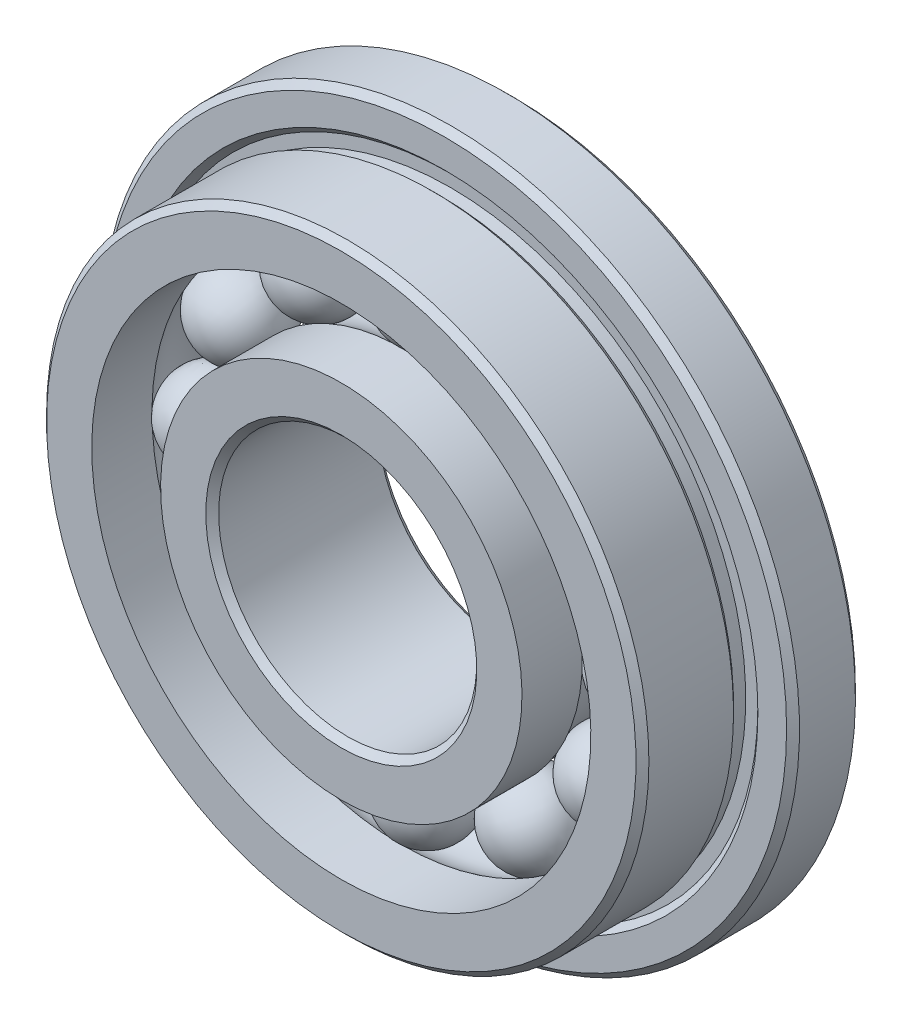
ISO-10303-21;
HEADER;
FILE_DESCRIPTION(('STEP AP214'),'2;1');
FILE_NAME('part.step','',(''),(''),'','','');
FILE_SCHEMA(('AUTOMOTIVE_DESIGN { 1 0 10303 214 1 1 1 1 }'));
ENDSEC;
DATA;
#1=APPLICATION_CONTEXT('core data for automotive mechanical design processes');
#2=APPLICATION_PROTOCOL_DEFINITION('international standard','automotive_design',2000,#1);
#3=PRODUCT_CONTEXT('',#1,'mechanical');
#4=PRODUCT('Part','Part','',(#3));
#5=PRODUCT_RELATED_PRODUCT_CATEGORY('part','',(#4));
#6=PRODUCT_DEFINITION_FORMATION('','',#4);
#7=PRODUCT_DEFINITION_CONTEXT('part definition',#1,'design');
#8=PRODUCT_DEFINITION('design','',#6,#7);
#9=PRODUCT_DEFINITION_SHAPE('','',#8);
#10=(LENGTH_UNIT() NAMED_UNIT(*) SI_UNIT(.MILLI.,.METRE.));
#11=(NAMED_UNIT(*) PLANE_ANGLE_UNIT() SI_UNIT($,.RADIAN.));
#12=(NAMED_UNIT(*) SI_UNIT($,.STERADIAN.) SOLID_ANGLE_UNIT());
#13=UNCERTAINTY_MEASURE_WITH_UNIT(LENGTH_MEASURE(1.E-05),#10,'distance_accuracy_value','');
#14=(GEOMETRIC_REPRESENTATION_CONTEXT(3) GLOBAL_UNCERTAINTY_ASSIGNED_CONTEXT((#13)) GLOBAL_UNIT_ASSIGNED_CONTEXT((#10,
#11,#12)) REPRESENTATION_CONTEXT('',''));
#15=CARTESIAN_POINT('',(0.,0.,0.));
#16=DIRECTION('',(0.,0.,1.));
#17=DIRECTION('',(1.,0.,0.));
#18=AXIS2_PLACEMENT_3D('',#15,#16,#17);
#19=CARTESIAN_POINT('',(-1.24999999999997,2.16506350946111,0.));
#20=DIRECTION('',(-0.499999999999989,0.866025403784445,0.));
#21=DIRECTION('',(0.866025403784445,0.499999999999989,0.));
#22=AXIS2_PLACEMENT_3D('',#19,#20,#21);
#23=SPHERICAL_SURFACE('',#22,0.5);
#24=CARTESIAN_POINT('',(-1.49999999999997,2.59807621135334,0.));
#25=VERTEX_POINT('',#24);
#26=VERTEX_LOOP('',#25);
#27=FACE_BOUND('',#26,.T.);
#28=ADVANCED_FACE('F39',(#27),#23,.T.);
#29=CLOSED_SHELL('',(#28));
#30=MANIFOLD_SOLID_BREP('B2',#29);
#31=CARTESIAN_POINT('',(-2.16506350946108,1.25000000000002,0.));
#32=DIRECTION('',(-0.866025403784433,0.50000000000001,0.));
#33=DIRECTION('',(0.50000000000001,0.866025403784433,0.));
#34=AXIS2_PLACEMENT_3D('',#31,#32,#33);
#35=SPHERICAL_SURFACE('',#34,0.5);
#36=CARTESIAN_POINT('',(-2.5980762113533,1.50000000000003,0.));
#37=VERTEX_POINT('',#36);
#38=VERTEX_LOOP('',#37);
#39=FACE_BOUND('',#38,.T.);
#40=ADVANCED_FACE('F57',(#39),#35,.T.);
#41=CLOSED_SHELL('',(#40));
#42=MANIFOLD_SOLID_BREP('B7',#41);
#43=CARTESIAN_POINT('',(-2.5,0.,0.));
#44=DIRECTION('',(-1.,0.,0.));
#45=DIRECTION('',(0.,1.,0.));
#46=AXIS2_PLACEMENT_3D('',#43,#44,#45);
#47=SPHERICAL_SURFACE('',#46,0.5);
#48=CARTESIAN_POINT('',(-3.,0.,0.));
#49=VERTEX_POINT('',#48);
#50=VERTEX_LOOP('',#49);
#51=FACE_BOUND('',#50,.T.);
#52=ADVANCED_FACE('F75',(#51),#47,.T.);
#53=CLOSED_SHELL('',(#52));
#54=MANIFOLD_SOLID_BREP('B35',#53);
#55=CARTESIAN_POINT('',(-2.16506350946111,-1.24999999999998,0.));
#56=DIRECTION('',(-0.866025403784443,-0.499999999999992,0.));
#57=DIRECTION('',(-0.499999999999992,0.866025403784443,0.));
#58=AXIS2_PLACEMENT_3D('',#55,#56,#57);
#59=SPHERICAL_SURFACE('',#58,0.5);
#60=CARTESIAN_POINT('',(-2.59807621135333,-1.49999999999998,0.));
#61=VERTEX_POINT('',#60);
#62=VERTEX_LOOP('',#61);
#63=FACE_BOUND('',#62,.T.);
#64=ADVANCED_FACE('F93',(#63),#59,.T.);
#65=CLOSED_SHELL('',(#64));
#66=MANIFOLD_SOLID_BREP('B53',#65);
#67=CARTESIAN_POINT('',(-1.25000000000002,-2.16506350946109,0.));
#68=DIRECTION('',(-0.500000000000007,-0.866025403784435,0.));
#69=DIRECTION('',(-0.866025403784435,0.500000000000007,0.));
#70=AXIS2_PLACEMENT_3D('',#67,#68,#69);
#71=SPHERICAL_SURFACE('',#70,0.5);
#72=CARTESIAN_POINT('',(-1.50000000000002,-2.5980762113533,0.));
#73=VERTEX_POINT('',#72);
#74=VERTEX_LOOP('',#73);
#75=FACE_BOUND('',#74,.T.);
#76=ADVANCED_FACE('F111',(#75),#71,.T.);
#77=CLOSED_SHELL('',(#76));
#78=MANIFOLD_SOLID_BREP('B71',#77);
#79=CARTESIAN_POINT('',(0.,-2.5,0.));
#80=DIRECTION('',(0.,-1.,0.));
#81=DIRECTION('',(-1.,0.,0.));
#82=AXIS2_PLACEMENT_3D('',#79,#80,#81);
#83=SPHERICAL_SURFACE('',#82,0.5);
#84=CARTESIAN_POINT('',(0.,-3.,0.));
#85=VERTEX_POINT('',#84);
#86=VERTEX_LOOP('',#85);
#87=FACE_BOUND('',#86,.T.);
#88=ADVANCED_FACE('F129',(#87),#83,.T.);
#89=CLOSED_SHELL('',(#88));
#90=MANIFOLD_SOLID_BREP('B89',#89);
#91=CARTESIAN_POINT('',(1.24999999999999,-2.1650635094611,0.));
#92=DIRECTION('',(0.499999999999995,-0.866025403784442,0.));
#93=DIRECTION('',(-0.866025403784442,-0.499999999999995,0.));
#94=AXIS2_PLACEMENT_3D('',#91,#92,#93);
#95=SPHERICAL_SURFACE('',#94,0.5);
#96=CARTESIAN_POINT('',(1.49999999999998,-2.59807621135332,0.));
#97=VERTEX_POINT('',#96);
#98=VERTEX_LOOP('',#97);
#99=FACE_BOUND('',#98,.T.);
#100=ADVANCED_FACE('F147',(#99),#95,.T.);
#101=CLOSED_SHELL('',(#100));
#102=MANIFOLD_SOLID_BREP('B107',#101);
#103=CARTESIAN_POINT('',(2.16506350946109,-1.25000000000001,0.));
#104=DIRECTION('',(0.866025403784436,-0.500000000000004,0.));
#105=DIRECTION('',(-0.500000000000004,-0.866025403784436,0.));
#106=AXIS2_PLACEMENT_3D('',#103,#104,#105);
#107=SPHERICAL_SURFACE('',#106,0.5);
#108=CARTESIAN_POINT('',(2.59807621135331,-1.50000000000001,0.));
#109=VERTEX_POINT('',#108);
#110=VERTEX_LOOP('',#109);
#111=FACE_BOUND('',#110,.T.);
#112=ADVANCED_FACE('F165',(#111),#107,.T.);
#113=CLOSED_SHELL('',(#112));
#114=MANIFOLD_SOLID_BREP('B125',#113);
#115=CARTESIAN_POINT('',(2.5,0.,0.));
#116=DIRECTION('',(1.,0.,0.));
#117=DIRECTION('',(0.,-1.,0.));
#118=AXIS2_PLACEMENT_3D('',#115,#116,#117);
#119=SPHERICAL_SURFACE('',#118,0.5);
#120=CARTESIAN_POINT('',(3.,0.,0.));
#121=VERTEX_POINT('',#120);
#122=VERTEX_LOOP('',#121);
#123=FACE_BOUND('',#122,.T.);
#124=ADVANCED_FACE('F183',(#123),#119,.T.);
#125=CLOSED_SHELL('',(#124));
#126=MANIFOLD_SOLID_BREP('B143',#125);
#127=CARTESIAN_POINT('',(2.1650635094611,1.24999999999999,0.));
#128=DIRECTION('',(0.86602540378444,0.499999999999998,0.));
#129=DIRECTION('',(0.499999999999998,-0.86602540378444,0.));
#130=AXIS2_PLACEMENT_3D('',#127,#128,#129);
#131=SPHERICAL_SURFACE('',#130,0.5);
#132=CARTESIAN_POINT('',(2.59807621135332,1.49999999999999,0.));
#133=VERTEX_POINT('',#132);
#134=VERTEX_LOOP('',#133);
#135=FACE_BOUND('',#134,.T.);
#136=ADVANCED_FACE('F201',(#135),#131,.T.);
#137=CLOSED_SHELL('',(#136));
#138=MANIFOLD_SOLID_BREP('B161',#137);
#139=CARTESIAN_POINT('',(1.25,2.1650635094611,0.));
#140=DIRECTION('',(0.500000000000001,0.866025403784438,0.));
#141=DIRECTION('',(0.866025403784438,-0.500000000000001,0.));
#142=AXIS2_PLACEMENT_3D('',#139,#140,#141);
#143=SPHERICAL_SURFACE('',#142,0.5);
#144=CARTESIAN_POINT('',(1.5,2.59807621135331,0.));
#145=VERTEX_POINT('',#144);
#146=VERTEX_LOOP('',#145);
#147=FACE_BOUND('',#146,.T.);
#148=ADVANCED_FACE('F219',(#147),#143,.T.);
#149=CLOSED_SHELL('',(#148));
#150=MANIFOLD_SOLID_BREP('B179',#149);
#151=CARTESIAN_POINT('',(0.,2.5,0.));
#152=DIRECTION('',(0.,1.,0.));
#153=DIRECTION('',(1.,0.,0.));
#154=AXIS2_PLACEMENT_3D('',#151,#152,#153);
#155=SPHERICAL_SURFACE('',#154,0.5);
#156=CARTESIAN_POINT('',(0.,3.,0.));
#157=VERTEX_POINT('',#156);
#158=VERTEX_LOOP('',#157);
#159=FACE_BOUND('',#158,.T.);
#160=ADVANCED_FACE('F240',(#159),#155,.T.);
#161=CLOSED_SHELL('',(#160));
#162=MANIFOLD_SOLID_BREP('B197',#161);
#163=CARTESIAN_POINT('',(0.,0.,0.));
#164=DIRECTION('',(0.,0.,1.));
#165=DIRECTION('',(0.,-1.,0.));
#166=AXIS2_PLACEMENT_3D('',#163,#164,#165);
#167=CYLINDRICAL_SURFACE('',#166,2.1);
#168=CARTESIAN_POINT('',(0.,0.,-0.3));
#169=DIRECTION('',(0.,0.,1.));
#170=DIRECTION('',(0.,-1.,0.));
#171=AXIS2_PLACEMENT_3D('',#168,#169,#170);
#172=CIRCLE('',#171,2.1);
#173=CARTESIAN_POINT('',(0.,-2.1,-0.3));
#174=VERTEX_POINT('',#173);
#175=EDGE_CURVE('E281',#174,#174,#172,.T.);
#176=ORIENTED_EDGE('',*,*,#175,.F.);
#177=EDGE_LOOP('',(#176));
#178=FACE_BOUND('',#177,.T.);
#179=CARTESIAN_POINT('',(0.,0.,-1.));
#180=DIRECTION('',(0.,0.,1.));
#181=DIRECTION('',(0.,-1.,0.));
#182=AXIS2_PLACEMENT_3D('',#179,#180,#181);
#183=CIRCLE('',#182,2.1);
#184=CARTESIAN_POINT('',(0.,-2.1,-1.));
#185=VERTEX_POINT('',#184);
#186=EDGE_CURVE('E290',#185,#185,#183,.T.);
#187=ORIENTED_EDGE('',*,*,#186,.T.);
#188=EDGE_LOOP('',(#187));
#189=FACE_BOUND('',#188,.T.);
#190=ADVANCED_FACE('F261',(#178,#189),#167,.T.);
#191=CARTESIAN_POINT('',(0.,0.,0.));
#192=DIRECTION('',(0.,0.,1.));
#193=DIRECTION('',(0.,-1.,0.));
#194=AXIS2_PLACEMENT_3D('',#191,#192,#193);
#195=TOROIDAL_SURFACE('',#194,2.5,0.5);
#196=CARTESIAN_POINT('',(0.,0.,0.3));
#197=DIRECTION('',(0.,0.,1.));
#198=DIRECTION('',(0.,-1.,0.));
#199=AXIS2_PLACEMENT_3D('',#196,#197,#198);
#200=CIRCLE('',#199,2.1);
#201=CARTESIAN_POINT('',(0.,-2.1,0.3));
#202=VERTEX_POINT('',#201);
#203=EDGE_CURVE('E284',#202,#202,#200,.T.);
#204=ORIENTED_EDGE('',*,*,#203,.F.);
#205=EDGE_LOOP('',(#204));
#206=FACE_BOUND('',#205,.T.);
#207=ORIENTED_EDGE('',*,*,#175,.T.);
#208=EDGE_LOOP('',(#207));
#209=FACE_BOUND('',#208,.T.);
#210=ADVANCED_FACE('F309',(#206,#209),#195,.F.);
#211=CARTESIAN_POINT('',(0.,0.,0.));
#212=DIRECTION('',(0.,0.,1.));
#213=DIRECTION('',(0.,-1.,0.));
#214=AXIS2_PLACEMENT_3D('',#211,#212,#213);
#215=CYLINDRICAL_SURFACE('',#214,2.1);
#216=CARTESIAN_POINT('',(0.,0.,1.));
#217=DIRECTION('',(0.,0.,1.));
#218=DIRECTION('',(0.,-1.,0.));
#219=AXIS2_PLACEMENT_3D('',#216,#217,#218);
#220=CIRCLE('',#219,2.1);
#221=CARTESIAN_POINT('',(0.,-2.1,1.));
#222=VERTEX_POINT('',#221);
#223=EDGE_CURVE('E287',#222,#222,#220,.T.);
#224=ORIENTED_EDGE('',*,*,#223,.F.);
#225=EDGE_LOOP('',(#224));
#226=FACE_BOUND('',#225,.T.);
#227=ORIENTED_EDGE('',*,*,#203,.T.);
#228=EDGE_LOOP('',(#227));
#229=FACE_BOUND('',#228,.T.);
#230=ADVANCED_FACE('F315',(#226,#229),#215,.T.);
#231=CARTESIAN_POINT('',(0.,1.5,1.));
#232=DIRECTION('',(0.,0.,-1.));
#233=DIRECTION('',(0.,1.,0.));
#234=AXIS2_PLACEMENT_3D('',#231,#232,#233);
#235=PLANE('',#234);
#236=CARTESIAN_POINT('',(0.,0.,1.));
#237=DIRECTION('',(0.,0.,-1.));
#238=DIRECTION('',(0.,1.,0.));
#239=AXIS2_PLACEMENT_3D('',#236,#237,#238);
#240=CIRCLE('',#239,1.575);
#241=CARTESIAN_POINT('',(0.,1.575,1.));
#242=VERTEX_POINT('',#241);
#243=EDGE_CURVE('E239',#242,#242,#240,.T.);
#244=ORIENTED_EDGE('',*,*,#243,.T.);
#245=EDGE_LOOP('',(#244));
#246=FACE_BOUND('',#245,.T.);
#247=ORIENTED_EDGE('',*,*,#223,.T.);
#248=EDGE_LOOP('',(#247));
#249=FACE_BOUND('',#248,.T.);
#250=ADVANCED_FACE('F306',(#246,#249),#235,.F.);
#251=CARTESIAN_POINT('',(0.,0.,0.));
#252=DIRECTION('',(0.,0.,1.));
#253=DIRECTION('',(0.,-1.,0.));
#254=AXIS2_PLACEMENT_3D('',#251,#252,#253);
#255=CYLINDRICAL_SURFACE('',#254,1.5);
#256=CARTESIAN_POINT('',(0.,0.,-0.925000000000001));
#257=DIRECTION('',(0.,0.,1.));
#258=DIRECTION('',(0.,-1.,0.));
#259=AXIS2_PLACEMENT_3D('',#256,#257,#258);
#260=CIRCLE('',#259,1.5);
#261=CARTESIAN_POINT('',(0.,-1.5,-0.925000000000001));
#262=VERTEX_POINT('',#261);
#263=EDGE_CURVE('E268',#262,#262,#260,.F.);
#264=ORIENTED_EDGE('',*,*,#263,.T.);
#265=EDGE_LOOP('',(#264));
#266=FACE_BOUND('',#265,.T.);
#267=CARTESIAN_POINT('',(0.,0.,0.925));
#268=DIRECTION('',(0.,0.,-1.));
#269=DIRECTION('',(0.,1.,0.));
#270=AXIS2_PLACEMENT_3D('',#267,#268,#269);
#271=CIRCLE('',#270,1.5);
#272=CARTESIAN_POINT('',(0.,1.5,0.925));
#273=VERTEX_POINT('',#272);
#274=EDGE_CURVE('E272',#273,#273,#271,.F.);
#275=ORIENTED_EDGE('',*,*,#274,.T.);
#276=EDGE_LOOP('',(#275));
#277=FACE_BOUND('',#276,.T.);
#278=ADVANCED_FACE('F298',(#266,#277),#255,.F.);
#279=CARTESIAN_POINT('',(0.,2.1,-1.));
#280=DIRECTION('',(0.,0.,1.));
#281=DIRECTION('',(0.,-1.,0.));
#282=AXIS2_PLACEMENT_3D('',#279,#280,#281);
#283=PLANE('',#282);
#284=CARTESIAN_POINT('',(0.,0.,-1.));
#285=DIRECTION('',(0.,0.,1.));
#286=DIRECTION('',(0.,-1.,0.));
#287=AXIS2_PLACEMENT_3D('',#284,#285,#286);
#288=CIRCLE('',#287,1.575);
#289=CARTESIAN_POINT('',(0.,-1.575,-1.));
#290=VERTEX_POINT('',#289);
#291=EDGE_CURVE('E276',#290,#290,#288,.T.);
#292=ORIENTED_EDGE('',*,*,#291,.T.);
#293=EDGE_LOOP('',(#292));
#294=FACE_BOUND('',#293,.T.);
#295=ORIENTED_EDGE('',*,*,#186,.F.);
#296=EDGE_LOOP('',(#295));
#297=FACE_BOUND('',#296,.T.);
#298=ADVANCED_FACE('F295',(#294,#297),#283,.F.);
#299=CARTESIAN_POINT('',(0.,0.,-1.));
#300=DIRECTION('',(0.,0.,-1.));
#301=DIRECTION('',(0.,1.,0.));
#302=AXIS2_PLACEMENT_3D('',#299,#300,#301);
#303=CONICAL_SURFACE('',#302,1.575,0.785398163397448);
#304=ORIENTED_EDGE('',*,*,#263,.F.);
#305=EDGE_LOOP('',(#304));
#306=FACE_BOUND('',#305,.T.);
#307=ORIENTED_EDGE('',*,*,#291,.F.);
#308=EDGE_LOOP('',(#307));
#309=FACE_BOUND('',#308,.T.);
#310=ADVANCED_FACE('F297',(#306,#309),#303,.F.);
#311=CARTESIAN_POINT('',(0.,0.,0.925));
#312=DIRECTION('',(0.,0.,1.));
#313=DIRECTION('',(0.,-1.,0.));
#314=AXIS2_PLACEMENT_3D('',#311,#312,#313);
#315=CONICAL_SURFACE('',#314,1.5,0.785398163397448);
#316=ORIENTED_EDGE('',*,*,#243,.F.);
#317=EDGE_LOOP('',(#316));
#318=FACE_BOUND('',#317,.T.);
#319=ORIENTED_EDGE('',*,*,#274,.F.);
#320=EDGE_LOOP('',(#319));
#321=FACE_BOUND('',#320,.T.);
#322=ADVANCED_FACE('F263',(#318,#321),#315,.F.);
#323=CLOSED_SHELL('',(#190,#210,#230,#250,#278,#298,#310,#322));
#324=MANIFOLD_SOLID_BREP('B215',#323);
#325=CARTESIAN_POINT('',(0.,2.9,-1.));
#326=DIRECTION('',(0.,0.,1.));
#327=DIRECTION('',(0.,-1.,0.));
#328=AXIS2_PLACEMENT_3D('',#325,#326,#327);
#329=PLANE('',#328);
#330=CARTESIAN_POINT('',(0.,0.,-1.));
#331=DIRECTION('',(0.,0.,1.));
#332=DIRECTION('',(0.,-1.,0.));
#333=AXIS2_PLACEMENT_3D('',#330,#331,#332);
#334=CIRCLE('',#333,3.975);
#335=CARTESIAN_POINT('',(0.,-3.975,-1.));
#336=VERTEX_POINT('',#335);
#337=EDGE_CURVE('E398',#336,#336,#334,.F.);
#338=ORIENTED_EDGE('',*,*,#337,.T.);
#339=EDGE_LOOP('',(#338));
#340=FACE_BOUND('',#339,.T.);
#341=CARTESIAN_POINT('',(0.,0.,-1.));
#342=DIRECTION('',(0.,0.,1.));
#343=DIRECTION('',(0.,-1.,0.));
#344=AXIS2_PLACEMENT_3D('',#341,#342,#343);
#345=CIRCLE('',#344,2.9);
#346=CARTESIAN_POINT('',(0.,-2.9,-1.));
#347=VERTEX_POINT('',#346);
#348=EDGE_CURVE('E409',#347,#347,#345,.T.);
#349=ORIENTED_EDGE('',*,*,#348,.T.);
#350=EDGE_LOOP('',(#349));
#351=FACE_BOUND('',#350,.T.);
#352=ADVANCED_FACE('F383',(#340,#351),#329,.F.);
#353=CARTESIAN_POINT('',(0.,0.,0.));
#354=DIRECTION('',(0.,0.,1.));
#355=DIRECTION('',(0.,-1.,0.));
#356=AXIS2_PLACEMENT_3D('',#353,#354,#355);
#357=CYLINDRICAL_SURFACE('',#356,2.9);
#358=ORIENTED_EDGE('',*,*,#348,.F.);
#359=EDGE_LOOP('',(#358));
#360=FACE_BOUND('',#359,.T.);
#361=CARTESIAN_POINT('',(0.,0.,-0.3));
#362=DIRECTION('',(0.,0.,1.));
#363=DIRECTION('',(0.,-1.,0.));
#364=AXIS2_PLACEMENT_3D('',#361,#362,#363);
#365=CIRCLE('',#364,2.9);
#366=CARTESIAN_POINT('',(0.,-2.9,-0.3));
#367=VERTEX_POINT('',#366);
#368=EDGE_CURVE('E412',#367,#367,#365,.T.);
#369=ORIENTED_EDGE('',*,*,#368,.T.);
#370=EDGE_LOOP('',(#369));
#371=FACE_BOUND('',#370,.T.);
#372=ADVANCED_FACE('F455',(#360,#371),#357,.F.);
#373=CARTESIAN_POINT('',(0.,0.,0.));
#374=DIRECTION('',(0.,0.,1.));
#375=DIRECTION('',(0.,-1.,0.));
#376=AXIS2_PLACEMENT_3D('',#373,#374,#375);
#377=TOROIDAL_SURFACE('',#376,2.5,0.5);
#378=ORIENTED_EDGE('',*,*,#368,.F.);
#379=EDGE_LOOP('',(#378));
#380=FACE_BOUND('',#379,.T.);
#381=CARTESIAN_POINT('',(0.,0.,0.3));
#382=DIRECTION('',(0.,0.,1.));
#383=DIRECTION('',(0.,-1.,0.));
#384=AXIS2_PLACEMENT_3D('',#381,#382,#383);
#385=CIRCLE('',#384,2.9);
#386=CARTESIAN_POINT('',(0.,-2.9,0.3));
#387=VERTEX_POINT('',#386);
#388=EDGE_CURVE('E415',#387,#387,#385,.T.);
#389=ORIENTED_EDGE('',*,*,#388,.T.);
#390=EDGE_LOOP('',(#389));
#391=FACE_BOUND('',#390,.T.);
#392=ADVANCED_FACE('F461',(#380,#391),#377,.F.);
#393=CARTESIAN_POINT('',(0.,0.,0.));
#394=DIRECTION('',(0.,0.,1.));
#395=DIRECTION('',(0.,-1.,0.));
#396=AXIS2_PLACEMENT_3D('',#393,#394,#395);
#397=CYLINDRICAL_SURFACE('',#396,2.9);
#398=ORIENTED_EDGE('',*,*,#388,.F.);
#399=EDGE_LOOP('',(#398));
#400=FACE_BOUND('',#399,.T.);
#401=CARTESIAN_POINT('',(0.,0.,1.));
#402=DIRECTION('',(0.,0.,1.));
#403=DIRECTION('',(0.,-1.,0.));
#404=AXIS2_PLACEMENT_3D('',#401,#402,#403);
#405=CIRCLE('',#404,2.9);
#406=CARTESIAN_POINT('',(0.,-2.9,1.));
#407=VERTEX_POINT('',#406);
#408=EDGE_CURVE('E418',#407,#407,#405,.T.);
#409=ORIENTED_EDGE('',*,*,#408,.T.);
#410=EDGE_LOOP('',(#409));
#411=FACE_BOUND('',#410,.T.);
#412=ADVANCED_FACE('F525',(#400,#411),#397,.F.);
#413=CARTESIAN_POINT('',(0.,3.5,1.));
#414=DIRECTION('',(0.,0.,-1.));
#415=DIRECTION('',(0.,1.,0.));
#416=AXIS2_PLACEMENT_3D('',#413,#414,#415);
#417=PLANE('',#416);
#418=CARTESIAN_POINT('',(0.,0.,1.));
#419=DIRECTION('',(0.,0.,-1.));
#420=DIRECTION('',(0.,1.,0.));
#421=AXIS2_PLACEMENT_3D('',#418,#419,#420);
#422=CIRCLE('',#421,3.425);
#423=CARTESIAN_POINT('',(0.,3.425,1.));
#424=VERTEX_POINT('',#423);
#425=EDGE_CURVE('E390',#424,#424,#422,.F.);
#426=ORIENTED_EDGE('',*,*,#425,.T.);
#427=EDGE_LOOP('',(#426));
#428=FACE_BOUND('',#427,.T.);
#429=ORIENTED_EDGE('',*,*,#408,.F.);
#430=EDGE_LOOP('',(#429));
#431=FACE_BOUND('',#430,.T.);
#432=ADVANCED_FACE('F515',(#428,#431),#417,.F.);
#433=CARTESIAN_POINT('',(0.,0.,0.));
#434=DIRECTION('',(0.,0.,1.));
#435=DIRECTION('',(0.,-1.,0.));
#436=AXIS2_PLACEMENT_3D('',#433,#434,#435);
#437=CYLINDRICAL_SURFACE('',#436,3.5);
#438=CARTESIAN_POINT('',(0.,0.,0.925));
#439=DIRECTION('',(0.,0.,-1.));
#440=DIRECTION('',(0.,1.,0.));
#441=AXIS2_PLACEMENT_3D('',#438,#439,#440);
#442=CIRCLE('',#441,3.5);
#443=CARTESIAN_POINT('',(0.,3.5,0.925));
#444=VERTEX_POINT('',#443);
#445=EDGE_CURVE('E260',#444,#444,#442,.T.);
#446=ORIENTED_EDGE('',*,*,#445,.T.);
#447=EDGE_LOOP('',(#446));
#448=FACE_BOUND('',#447,.T.);
#449=CARTESIAN_POINT('',(0.,0.,-0.0585786437626918));
#450=DIRECTION('',(0.,0.,1.));
#451=DIRECTION('',(0.,-1.,0.));
#452=AXIS2_PLACEMENT_3D('',#449,#450,#451);
#453=CIRCLE('',#452,3.5);
#454=CARTESIAN_POINT('',(0.,-3.5,-0.0585786437626917));
#455=VERTEX_POINT('',#454);
#456=EDGE_CURVE('E421',#455,#455,#453,.T.);
#457=ORIENTED_EDGE('',*,*,#456,.T.);
#458=EDGE_LOOP('',(#457));
#459=FACE_BOUND('',#458,.T.);
#460=ADVANCED_FACE('F509',(#448,#459),#437,.T.);
#461=CARTESIAN_POINT('',(0.,0.,-0.129289321881346));
#462=DIRECTION('',(0.,0.,1.));
#463=DIRECTION('',(0.,-1.,0.));
#464=AXIS2_PLACEMENT_3D('',#461,#462,#463);
#465=CONICAL_SURFACE('',#464,3.42928932188135,0.785398163397449);
#466=ORIENTED_EDGE('',*,*,#456,.F.);
#467=EDGE_LOOP('',(#466));
#468=FACE_BOUND('',#467,.T.);
#469=CARTESIAN_POINT('',(0.,0.,-0.129289321881346));
#470=DIRECTION('',(0.,0.,1.));
#471=DIRECTION('',(0.,-1.,0.));
#472=AXIS2_PLACEMENT_3D('',#469,#470,#471);
#473=CIRCLE('',#472,3.42928932188135);
#474=CARTESIAN_POINT('',(0.,-3.42928932188135,-0.129289321881346));
#475=VERTEX_POINT('',#474);
#476=EDGE_CURVE('E424',#475,#475,#473,.T.);
#477=ORIENTED_EDGE('',*,*,#476,.T.);
#478=EDGE_LOOP('',(#477));
#479=FACE_BOUND('',#478,.T.);
#480=ADVANCED_FACE('F514',(#468,#479),#465,.T.);
#481=CARTESIAN_POINT('',(0.,0.,0.));
#482=DIRECTION('',(0.,0.,1.));
#483=DIRECTION('',(0.,-1.,0.));
#484=AXIS2_PLACEMENT_3D('',#481,#482,#483);
#485=CYLINDRICAL_SURFACE('',#484,3.42928932188135);
#486=ORIENTED_EDGE('',*,*,#476,.F.);
#487=EDGE_LOOP('',(#486));
#488=FACE_BOUND('',#487,.T.);
#489=CARTESIAN_POINT('',(0.,0.,-0.270710678118656));
#490=DIRECTION('',(0.,0.,1.));
#491=DIRECTION('',(0.,-1.,0.));
#492=AXIS2_PLACEMENT_3D('',#489,#490,#491);
#493=CIRCLE('',#492,3.42928932188135);
#494=CARTESIAN_POINT('',(0.,-3.42928932188135,-0.270710678118656));
#495=VERTEX_POINT('',#494);
#496=EDGE_CURVE('E427',#495,#495,#493,.T.);
#497=ORIENTED_EDGE('',*,*,#496,.T.);
#498=EDGE_LOOP('',(#497));
#499=FACE_BOUND('',#498,.T.);
#500=ADVANCED_FACE('F547',(#488,#499),#485,.T.);
#501=CARTESIAN_POINT('',(0.,3.57071067811866,-0.270710678118656));
#502=DIRECTION('',(0.,0.,-1.));
#503=DIRECTION('',(0.,1.,0.));
#504=AXIS2_PLACEMENT_3D('',#501,#502,#503);
#505=PLANE('',#504);
#506=ORIENTED_EDGE('',*,*,#496,.F.);
#507=EDGE_LOOP('',(#506));
#508=FACE_BOUND('',#507,.T.);
#509=CARTESIAN_POINT('',(0.,0.,-0.270710678118656));
#510=DIRECTION('',(0.,0.,1.));
#511=DIRECTION('',(0.,-1.,0.));
#512=AXIS2_PLACEMENT_3D('',#509,#510,#511);
#513=CIRCLE('',#512,3.57071067811866);
#514=CARTESIAN_POINT('',(0.,-3.57071067811866,-0.270710678118656));
#515=VERTEX_POINT('',#514);
#516=EDGE_CURVE('E430',#515,#515,#513,.T.);
#517=ORIENTED_EDGE('',*,*,#516,.T.);
#518=EDGE_LOOP('',(#517));
#519=FACE_BOUND('',#518,.T.);
#520=ADVANCED_FACE('F451',(#508,#519),#505,.F.);
#521=CARTESIAN_POINT('',(0.,0.,-0.200000000000001));
#522=DIRECTION('',(0.,0.,1.));
#523=DIRECTION('',(0.,-1.,0.));
#524=AXIS2_PLACEMENT_3D('',#521,#522,#523);
#525=CONICAL_SURFACE('',#524,3.64142135623731,0.78539816339745);
#526=ORIENTED_EDGE('',*,*,#516,.F.);
#527=EDGE_LOOP('',(#526));
#528=FACE_BOUND('',#527,.T.);
#529=CARTESIAN_POINT('',(0.,0.,-0.200000000000001));
#530=DIRECTION('',(0.,0.,1.));
#531=DIRECTION('',(0.,-1.,0.));
#532=AXIS2_PLACEMENT_3D('',#529,#530,#531);
#533=CIRCLE('',#532,3.64142135623731);
#534=CARTESIAN_POINT('',(0.,-3.64142135623731,-0.200000000000001));
#535=VERTEX_POINT('',#534);
#536=EDGE_CURVE('E433',#535,#535,#533,.T.);
#537=ORIENTED_EDGE('',*,*,#536,.T.);
#538=EDGE_LOOP('',(#537));
#539=FACE_BOUND('',#538,.T.);
#540=ADVANCED_FACE('F437',(#528,#539),#525,.F.);
#541=CARTESIAN_POINT('',(0.,4.05,-0.200000000000001));
#542=DIRECTION('',(0.,0.,-1.));
#543=DIRECTION('',(0.,1.,0.));
#544=AXIS2_PLACEMENT_3D('',#541,#542,#543);
#545=PLANE('',#544);
#546=CARTESIAN_POINT('',(0.,0.,-0.200000000000001));
#547=DIRECTION('',(0.,0.,-1.));
#548=DIRECTION('',(0.,1.,0.));
#549=AXIS2_PLACEMENT_3D('',#546,#547,#548);
#550=CIRCLE('',#549,3.975);
#551=CARTESIAN_POINT('',(0.,3.975,-0.200000000000001));
#552=VERTEX_POINT('',#551);
#553=EDGE_CURVE('E394',#552,#552,#550,.F.);
#554=ORIENTED_EDGE('',*,*,#553,.T.);
#555=EDGE_LOOP('',(#554));
#556=FACE_BOUND('',#555,.T.);
#557=ORIENTED_EDGE('',*,*,#536,.F.);
#558=EDGE_LOOP('',(#557));
#559=FACE_BOUND('',#558,.T.);
#560=ADVANCED_FACE('F439',(#556,#559),#545,.F.);
#561=CARTESIAN_POINT('',(0.,0.,0.));
#562=DIRECTION('',(0.,0.,1.));
#563=DIRECTION('',(0.,-1.,0.));
#564=AXIS2_PLACEMENT_3D('',#561,#562,#563);
#565=CYLINDRICAL_SURFACE('',#564,4.05);
#566=CARTESIAN_POINT('',(0.,0.,-0.925000000000001));
#567=DIRECTION('',(0.,0.,1.));
#568=DIRECTION('',(0.,-1.,0.));
#569=AXIS2_PLACEMENT_3D('',#566,#567,#568);
#570=CIRCLE('',#569,4.05);
#571=CARTESIAN_POINT('',(0.,-4.05,-0.925000000000001));
#572=VERTEX_POINT('',#571);
#573=EDGE_CURVE('E403',#572,#572,#570,.T.);
#574=ORIENTED_EDGE('',*,*,#573,.T.);
#575=EDGE_LOOP('',(#574));
#576=FACE_BOUND('',#575,.T.);
#577=CARTESIAN_POINT('',(0.,0.,-0.275000000000001));
#578=DIRECTION('',(0.,0.,-1.));
#579=DIRECTION('',(0.,1.,0.));
#580=AXIS2_PLACEMENT_3D('',#577,#578,#579);
#581=CIRCLE('',#580,4.05);
#582=CARTESIAN_POINT('',(0.,4.05,-0.275000000000001));
#583=VERTEX_POINT('',#582);
#584=EDGE_CURVE('E406',#583,#583,#581,.T.);
#585=ORIENTED_EDGE('',*,*,#584,.T.);
#586=EDGE_LOOP('',(#585));
#587=FACE_BOUND('',#586,.T.);
#588=ADVANCED_FACE('F441',(#576,#587),#565,.T.);
#589=CARTESIAN_POINT('',(0.,0.,-0.925000000000001));
#590=DIRECTION('',(0.,0.,1.));
#591=DIRECTION('',(0.,-1.,0.));
#592=AXIS2_PLACEMENT_3D('',#589,#590,#591);
#593=CONICAL_SURFACE('',#592,4.05,0.785398163397451);
#594=ORIENTED_EDGE('',*,*,#337,.F.);
#595=EDGE_LOOP('',(#594));
#596=FACE_BOUND('',#595,.T.);
#597=ORIENTED_EDGE('',*,*,#573,.F.);
#598=EDGE_LOOP('',(#597));
#599=FACE_BOUND('',#598,.T.);
#600=ADVANCED_FACE('F448',(#596,#599),#593,.T.);
#601=CARTESIAN_POINT('',(0.,0.,-0.200000000000001));
#602=DIRECTION('',(0.,0.,-1.));
#603=DIRECTION('',(0.,1.,0.));
#604=AXIS2_PLACEMENT_3D('',#601,#602,#603);
#605=CONICAL_SURFACE('',#604,3.975,0.785398163397451);
#606=ORIENTED_EDGE('',*,*,#584,.F.);
#607=EDGE_LOOP('',(#606));
#608=FACE_BOUND('',#607,.T.);
#609=ORIENTED_EDGE('',*,*,#553,.F.);
#610=EDGE_LOOP('',(#609));
#611=FACE_BOUND('',#610,.T.);
#612=ADVANCED_FACE('F468',(#608,#611),#605,.T.);
#613=CARTESIAN_POINT('',(0.,0.,1.));
#614=DIRECTION('',(0.,0.,-1.));
#615=DIRECTION('',(0.,1.,0.));
#616=AXIS2_PLACEMENT_3D('',#613,#614,#615);
#617=CONICAL_SURFACE('',#616,3.425,0.785398163397449);
#618=ORIENTED_EDGE('',*,*,#445,.F.);
#619=EDGE_LOOP('',(#618));
#620=FACE_BOUND('',#619,.T.);
#621=ORIENTED_EDGE('',*,*,#425,.F.);
#622=EDGE_LOOP('',(#621));
#623=FACE_BOUND('',#622,.T.);
#624=ADVANCED_FACE('F385',(#620,#623),#617,.T.);
#625=CLOSED_SHELL('',(#352,#372,#392,#412,#432,#460,#480,#500,#520,#540,#560,#588,#600,#612,#624));
#626=MANIFOLD_SOLID_BREP('B234',#625);
#627=ADVANCED_BREP_SHAPE_REPRESENTATION('',(#18,#30,#42,#54,#66,#78,#90,#102,#114,#126,#138,
#150,#162,#324,#626),#14);
#628=SHAPE_DEFINITION_REPRESENTATION(#9,#627);
ENDSEC;
END-ISO-10303-21;
